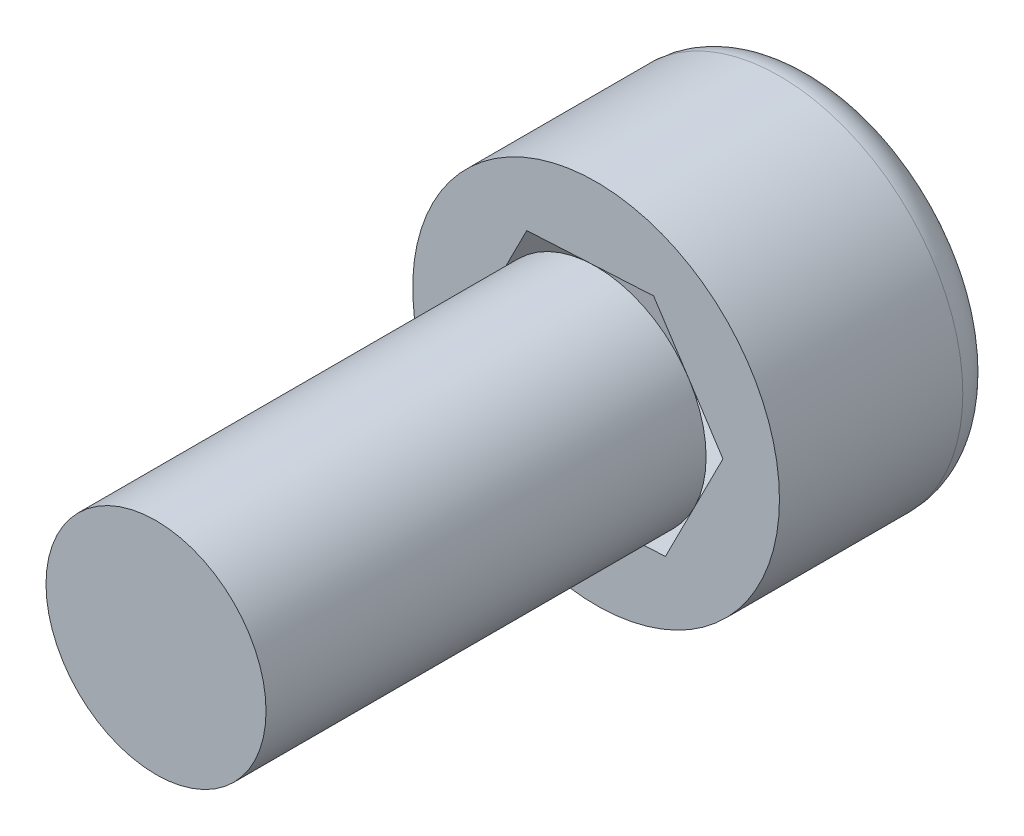
ISO-10303-21;
HEADER;
FILE_DESCRIPTION(('STEP AP214'),'2;1');
FILE_NAME('part.step','',(''),(''),'','','');
FILE_SCHEMA(('AUTOMOTIVE_DESIGN { 1 0 10303 214 1 1 1 1 }'));
ENDSEC;
DATA;
#1=APPLICATION_CONTEXT('core data for automotive mechanical design processes');
#2=APPLICATION_PROTOCOL_DEFINITION('international standard','automotive_design',2000,#1);
#3=PRODUCT_CONTEXT('',#1,'mechanical');
#4=PRODUCT('Part','Part','',(#3));
#5=PRODUCT_RELATED_PRODUCT_CATEGORY('part','',(#4));
#6=PRODUCT_DEFINITION_FORMATION('','',#4);
#7=PRODUCT_DEFINITION_CONTEXT('part definition',#1,'design');
#8=PRODUCT_DEFINITION('design','',#6,#7);
#9=PRODUCT_DEFINITION_SHAPE('','',#8);
#10=(LENGTH_UNIT() NAMED_UNIT(*) SI_UNIT(.MILLI.,.METRE.));
#11=(NAMED_UNIT(*) PLANE_ANGLE_UNIT() SI_UNIT($,.RADIAN.));
#12=(NAMED_UNIT(*) SI_UNIT($,.STERADIAN.) SOLID_ANGLE_UNIT());
#13=UNCERTAINTY_MEASURE_WITH_UNIT(LENGTH_MEASURE(1.E-05),#10,'distance_accuracy_value','');
#14=(GEOMETRIC_REPRESENTATION_CONTEXT(3) GLOBAL_UNCERTAINTY_ASSIGNED_CONTEXT((#13)) GLOBAL_UNIT_ASSIGNED_CONTEXT((#10,
#11,#12)) REPRESENTATION_CONTEXT('',''));
#15=CARTESIAN_POINT('',(0.,0.,0.));
#16=DIRECTION('',(0.,0.,1.));
#17=DIRECTION('',(1.,0.,0.));
#18=AXIS2_PLACEMENT_3D('',#15,#16,#17);
#19=CARTESIAN_POINT('',(0.,0.,3.));
#20=DIRECTION('',(0.,0.,-1.));
#21=DIRECTION('',(-1.,0.,0.));
#22=AXIS2_PLACEMENT_3D('',#19,#20,#21);
#23=CYLINDRICAL_SURFACE('',#22,2.5);
#24=CARTESIAN_POINT('',(0.,0.,0.5));
#25=DIRECTION('',(0.,0.,1.));
#26=DIRECTION('',(1.,0.,0.));
#27=AXIS2_PLACEMENT_3D('',#24,#25,#26);
#28=CIRCLE('',#27,2.5);
#29=CARTESIAN_POINT('',(2.5,0.,0.5));
#30=VERTEX_POINT('',#29);
#31=EDGE_CURVE('E50',#30,#30,#28,.T.);
#32=ORIENTED_EDGE('',*,*,#31,.T.);
#33=EDGE_LOOP('',(#32));
#34=FACE_BOUND('',#33,.T.);
#35=CARTESIAN_POINT('',(0.,0.,3.));
#36=DIRECTION('',(0.,0.,1.));
#37=DIRECTION('',(1.,0.,0.));
#38=AXIS2_PLACEMENT_3D('',#35,#36,#37);
#39=CIRCLE('',#38,2.5);
#40=CARTESIAN_POINT('',(2.5,0.,3.));
#41=VERTEX_POINT('',#40);
#42=EDGE_CURVE('E165',#41,#41,#39,.T.);
#43=ORIENTED_EDGE('',*,*,#42,.F.);
#44=EDGE_LOOP('',(#43));
#45=FACE_BOUND('',#44,.T.);
#46=ADVANCED_FACE('F41',(#34,#45),#23,.T.);
#47=CARTESIAN_POINT('',(0.,0.,3.));
#48=DIRECTION('',(0.,0.,1.));
#49=DIRECTION('',(1.,0.,0.));
#50=AXIS2_PLACEMENT_3D('',#47,#48,#49);
#51=PLANE('',#50);
#52=DIRECTION('',(-0.998565318577122,-0.0535472178079434,0.));
#53=VECTOR('',#52,1.);
#54=CARTESIAN_POINT('',(0.945103759937804,-1.45147472694203,3.));
#55=LINE('',#54,#53);
#56=CARTESIAN_POINT('',(0.945103759937804,-1.45147472694203,3.));
#57=VERTEX_POINT('',#56);
#58=CARTESIAN_POINT('',(-0.784462106513973,-1.54422122878934,3.));
#59=VERTEX_POINT('',#58);
#60=EDGE_CURVE('E94',#57,#59,#55,.T.);
#61=ORIENTED_EDGE('',*,*,#60,.T.);
#62=DIRECTION('',(-0.545655910212218,0.838009324321917,0.));
#63=VECTOR('',#62,1.);
#64=CARTESIAN_POINT('',(-0.784462106513973,-1.54422122878934,3.));
#65=LINE('',#64,#63);
#66=CARTESIAN_POINT('',(-1.72956586645178,-0.0927465018473138,3.));
#67=VERTEX_POINT('',#66);
#68=EDGE_CURVE('E57',#59,#67,#65,.T.);
#69=ORIENTED_EDGE('',*,*,#68,.T.);
#70=DIRECTION('',(0.452909408364904,0.89155654212986,0.));
#71=VECTOR('',#70,1.);
#72=CARTESIAN_POINT('',(-1.72956586645178,-0.0927465018473138,3.));
#73=LINE('',#72,#71);
#74=CARTESIAN_POINT('',(-0.945103759937803,1.45147472694203,3.));
#75=VERTEX_POINT('',#74);
#76=EDGE_CURVE('E104',#67,#75,#73,.T.);
#77=ORIENTED_EDGE('',*,*,#76,.T.);
#78=DIRECTION('',(0.998565318577122,0.0535472178079431,0.));
#79=VECTOR('',#78,1.);
#80=CARTESIAN_POINT('',(-0.945103759937803,1.45147472694203,3.));
#81=LINE('',#80,#79);
#82=CARTESIAN_POINT('',(0.784462106513974,1.54422122878934,3.));
#83=VERTEX_POINT('',#82);
#84=EDGE_CURVE('E176',#75,#83,#81,.T.);
#85=ORIENTED_EDGE('',*,*,#84,.T.);
#86=DIRECTION('',(0.545655910212218,-0.838009324321917,0.));
#87=VECTOR('',#86,1.);
#88=CARTESIAN_POINT('',(0.784462106513974,1.54422122878934,3.));
#89=LINE('',#88,#87);
#90=CARTESIAN_POINT('',(1.72956586645178,0.0927465018473145,3.));
#91=VERTEX_POINT('',#90);
#92=EDGE_CURVE('E174',#83,#91,#89,.T.);
#93=ORIENTED_EDGE('',*,*,#92,.T.);
#94=DIRECTION('',(-0.452909408364904,-0.89155654212986,0.));
#95=VECTOR('',#94,1.);
#96=CARTESIAN_POINT('',(1.72956586645178,0.0927465018473145,3.));
#97=LINE('',#96,#95);
#98=EDGE_CURVE('E109',#91,#57,#97,.T.);
#99=ORIENTED_EDGE('',*,*,#98,.T.);
#100=EDGE_LOOP('',(#61,#69,#77,#85,#93,#99));
#101=FACE_BOUND('',#100,.T.);
#102=ORIENTED_EDGE('',*,*,#42,.T.);
#103=EDGE_LOOP('',(#102));
#104=FACE_BOUND('',#103,.T.);
#105=ADVANCED_FACE('F106',(#101,#104),#51,.T.);
#106=CARTESIAN_POINT('',(0.,0.,0.));
#107=DIRECTION('',(0.,0.,1.));
#108=DIRECTION('',(1.,0.,0.));
#109=AXIS2_PLACEMENT_3D('',#106,#107,#108);
#110=PLANE('',#109);
#111=CARTESIAN_POINT('',(0.,0.,0.));
#112=DIRECTION('',(0.,0.,1.));
#113=DIRECTION('',(1.,0.,0.));
#114=AXIS2_PLACEMENT_3D('',#111,#112,#113);
#115=CIRCLE('',#114,2.);
#116=CARTESIAN_POINT('',(2.,0.,0.));
#117=VERTEX_POINT('',#116);
#118=EDGE_CURVE('E12',#117,#117,#115,.F.);
#119=ORIENTED_EDGE('',*,*,#118,.T.);
#120=EDGE_LOOP('',(#119));
#121=FACE_BOUND('',#120,.T.);
#122=DIRECTION('',(-0.545655910212218,0.838009324321917,0.));
#123=VECTOR('',#122,1.);
#124=CARTESIAN_POINT('',(-0.784462106513973,-1.54422122878934,0.));
#125=LINE('',#124,#123);
#126=CARTESIAN_POINT('',(-0.784462106513973,-1.54422122878934,0.));
#127=VERTEX_POINT('',#126);
#128=CARTESIAN_POINT('',(-1.72956586645178,-0.0927465018473138,0.));
#129=VERTEX_POINT('',#128);
#130=EDGE_CURVE('E99',#127,#129,#125,.T.);
#131=ORIENTED_EDGE('',*,*,#130,.F.);
#132=DIRECTION('',(-0.998565318577122,-0.0535472178079434,0.));
#133=VECTOR('',#132,1.);
#134=CARTESIAN_POINT('',(0.945103759937804,-1.45147472694203,0.));
#135=LINE('',#134,#133);
#136=CARTESIAN_POINT('',(0.945103759937804,-1.45147472694203,0.));
#137=VERTEX_POINT('',#136);
#138=EDGE_CURVE('E90',#137,#127,#135,.T.);
#139=ORIENTED_EDGE('',*,*,#138,.F.);
#140=DIRECTION('',(-0.452909408364904,-0.89155654212986,0.));
#141=VECTOR('',#140,1.);
#142=CARTESIAN_POINT('',(1.72956586645178,0.0927465018473145,0.));
#143=LINE('',#142,#141);
#144=CARTESIAN_POINT('',(1.72956586645178,0.0927465018473145,0.));
#145=VERTEX_POINT('',#144);
#146=EDGE_CURVE('E156',#145,#137,#143,.T.);
#147=ORIENTED_EDGE('',*,*,#146,.F.);
#148=DIRECTION('',(0.545655910212218,-0.838009324321917,0.));
#149=VECTOR('',#148,1.);
#150=CARTESIAN_POINT('',(0.784462106513974,1.54422122878934,0.));
#151=LINE('',#150,#149);
#152=CARTESIAN_POINT('',(0.784462106513974,1.54422122878934,0.));
#153=VERTEX_POINT('',#152);
#154=EDGE_CURVE('E189',#153,#145,#151,.T.);
#155=ORIENTED_EDGE('',*,*,#154,.F.);
#156=DIRECTION('',(0.998565318577122,0.0535472178079431,0.));
#157=VECTOR('',#156,1.);
#158=CARTESIAN_POINT('',(-0.945103759937803,1.45147472694203,0.));
#159=LINE('',#158,#157);
#160=CARTESIAN_POINT('',(-0.945103759937803,1.45147472694203,0.));
#161=VERTEX_POINT('',#160);
#162=EDGE_CURVE('E185',#161,#153,#159,.T.);
#163=ORIENTED_EDGE('',*,*,#162,.F.);
#164=DIRECTION('',(0.452909408364904,0.89155654212986,0.));
#165=VECTOR('',#164,1.);
#166=CARTESIAN_POINT('',(-1.72956586645178,-0.0927465018473138,0.));
#167=LINE('',#166,#165);
#168=EDGE_CURVE('E182',#129,#161,#167,.T.);
#169=ORIENTED_EDGE('',*,*,#168,.F.);
#170=EDGE_LOOP('',(#131,#139,#147,#155,#163,#169));
#171=FACE_BOUND('',#170,.T.);
#172=ADVANCED_FACE('F131',(#121,#171),#110,.F.);
#173=CARTESIAN_POINT('',(0.945103759937804,-1.45147472694203,3.));
#174=DIRECTION('',(0.0535472178079434,-0.998565318577122,0.));
#175=DIRECTION('',(0.998565318577122,0.0535472178079434,0.));
#176=AXIS2_PLACEMENT_3D('',#173,#174,#175);
#177=PLANE('',#176);
#178=ORIENTED_EDGE('',*,*,#138,.T.);
#179=DIRECTION('',(0.,0.,-1.));
#180=VECTOR('',#179,1.);
#181=CARTESIAN_POINT('',(-0.784462106513973,-1.54422122878934,3.));
#182=LINE('',#181,#180);
#183=EDGE_CURVE('E92',#59,#127,#182,.T.);
#184=ORIENTED_EDGE('',*,*,#183,.F.);
#185=ORIENTED_EDGE('',*,*,#60,.F.);
#186=DIRECTION('',(0.,0.,-1.));
#187=VECTOR('',#186,1.);
#188=CARTESIAN_POINT('',(0.945103759937804,-1.45147472694203,3.));
#189=LINE('',#188,#187);
#190=EDGE_CURVE('E157',#57,#137,#189,.T.);
#191=ORIENTED_EDGE('',*,*,#190,.T.);
#192=EDGE_LOOP('',(#178,#184,#185,#191));
#193=FACE_BOUND('',#192,.T.);
#194=ADVANCED_FACE('F93',(#193),#177,.F.);
#195=CARTESIAN_POINT('',(1.72956586645178,0.0927465018473145,3.));
#196=DIRECTION('',(0.89155654212986,-0.452909408364904,0.));
#197=DIRECTION('',(0.452909408364904,0.89155654212986,0.));
#198=AXIS2_PLACEMENT_3D('',#195,#196,#197);
#199=PLANE('',#198);
#200=ORIENTED_EDGE('',*,*,#146,.T.);
#201=ORIENTED_EDGE('',*,*,#190,.F.);
#202=ORIENTED_EDGE('',*,*,#98,.F.);
#203=DIRECTION('',(0.,0.,-1.));
#204=VECTOR('',#203,1.);
#205=CARTESIAN_POINT('',(1.72956586645178,0.0927465018473145,3.));
#206=LINE('',#205,#204);
#207=EDGE_CURVE('E159',#91,#145,#206,.T.);
#208=ORIENTED_EDGE('',*,*,#207,.T.);
#209=EDGE_LOOP('',(#200,#201,#202,#208));
#210=FACE_BOUND('',#209,.T.);
#211=ADVANCED_FACE('F138',(#210),#199,.F.);
#212=CARTESIAN_POINT('',(0.784462106513974,1.54422122878934,3.));
#213=DIRECTION('',(0.838009324321917,0.545655910212218,0.));
#214=DIRECTION('',(-0.545655910212218,0.838009324321917,0.));
#215=AXIS2_PLACEMENT_3D('',#212,#213,#214);
#216=PLANE('',#215);
#217=ORIENTED_EDGE('',*,*,#154,.T.);
#218=ORIENTED_EDGE('',*,*,#207,.F.);
#219=ORIENTED_EDGE('',*,*,#92,.F.);
#220=DIRECTION('',(0.,0.,-1.));
#221=VECTOR('',#220,1.);
#222=CARTESIAN_POINT('',(0.784462106513974,1.54422122878934,3.));
#223=LINE('',#222,#221);
#224=EDGE_CURVE('E187',#83,#153,#223,.T.);
#225=ORIENTED_EDGE('',*,*,#224,.T.);
#226=EDGE_LOOP('',(#217,#218,#219,#225));
#227=FACE_BOUND('',#226,.T.);
#228=ADVANCED_FACE('F146',(#227),#216,.F.);
#229=CARTESIAN_POINT('',(-0.945103759937803,1.45147472694203,3.));
#230=DIRECTION('',(-0.0535472178079431,0.998565318577122,0.));
#231=DIRECTION('',(-0.998565318577122,-0.0535472178079432,0.));
#232=AXIS2_PLACEMENT_3D('',#229,#230,#231);
#233=PLANE('',#232);
#234=ORIENTED_EDGE('',*,*,#162,.T.);
#235=ORIENTED_EDGE('',*,*,#224,.F.);
#236=ORIENTED_EDGE('',*,*,#84,.F.);
#237=DIRECTION('',(0.,0.,-1.));
#238=VECTOR('',#237,1.);
#239=CARTESIAN_POINT('',(-0.945103759937803,1.45147472694203,3.));
#240=LINE('',#239,#238);
#241=EDGE_CURVE('E181',#75,#161,#240,.T.);
#242=ORIENTED_EDGE('',*,*,#241,.T.);
#243=EDGE_LOOP('',(#234,#235,#236,#242));
#244=FACE_BOUND('',#243,.T.);
#245=ADVANCED_FACE('F142',(#244),#233,.F.);
#246=CARTESIAN_POINT('',(-1.72956586645178,-0.0927465018473138,3.));
#247=DIRECTION('',(-0.89155654212986,0.452909408364904,0.));
#248=DIRECTION('',(-0.452909408364904,-0.89155654212986,0.));
#249=AXIS2_PLACEMENT_3D('',#246,#247,#248);
#250=PLANE('',#249);
#251=ORIENTED_EDGE('',*,*,#168,.T.);
#252=ORIENTED_EDGE('',*,*,#241,.F.);
#253=ORIENTED_EDGE('',*,*,#76,.F.);
#254=DIRECTION('',(0.,0.,-1.));
#255=VECTOR('',#254,1.);
#256=CARTESIAN_POINT('',(-1.72956586645178,-0.0927465018473138,3.));
#257=LINE('',#256,#255);
#258=EDGE_CURVE('E102',#67,#129,#257,.T.);
#259=ORIENTED_EDGE('',*,*,#258,.T.);
#260=EDGE_LOOP('',(#251,#252,#253,#259));
#261=FACE_BOUND('',#260,.T.);
#262=ADVANCED_FACE('F123',(#261),#250,.F.);
#263=CARTESIAN_POINT('',(-0.784462106513973,-1.54422122878934,3.));
#264=DIRECTION('',(-0.838009324321917,-0.545655910212218,0.));
#265=DIRECTION('',(0.545655910212218,-0.838009324321917,0.));
#266=AXIS2_PLACEMENT_3D('',#263,#264,#265);
#267=PLANE('',#266);
#268=ORIENTED_EDGE('',*,*,#130,.T.);
#269=ORIENTED_EDGE('',*,*,#258,.F.);
#270=ORIENTED_EDGE('',*,*,#68,.F.);
#271=ORIENTED_EDGE('',*,*,#183,.T.);
#272=EDGE_LOOP('',(#268,#269,#270,#271));
#273=FACE_BOUND('',#272,.T.);
#274=ADVANCED_FACE('F101',(#273),#267,.F.);
#275=CARTESIAN_POINT('',(0.,0.,0.5));
#276=DIRECTION('',(0.,0.,1.));
#277=DIRECTION('',(1.,0.,0.));
#278=AXIS2_PLACEMENT_3D('',#275,#276,#277);
#279=TOROIDAL_SURFACE('',#278,2.,0.5);
#280=ORIENTED_EDGE('',*,*,#118,.F.);
#281=EDGE_LOOP('',(#280));
#282=FACE_BOUND('',#281,.T.);
#283=ORIENTED_EDGE('',*,*,#31,.F.);
#284=EDGE_LOOP('',(#283));
#285=FACE_BOUND('',#284,.T.);
#286=ADVANCED_FACE('F43',(#282,#285),#279,.T.);
#287=CLOSED_SHELL('',(#46,#105,#172,#194,#211,#228,#245,#262,#274,#286));
#288=MANIFOLD_SOLID_BREP('B2',#287);
#289=CARTESIAN_POINT('',(0.,0.,9.));
#290=DIRECTION('',(0.,0.,1.));
#291=DIRECTION('',(1.,0.,0.));
#292=AXIS2_PLACEMENT_3D('',#289,#290,#291);
#293=PLANE('',#292);
#294=CARTESIAN_POINT('',(0.,0.,9.));
#295=DIRECTION('',(0.,0.,1.));
#296=DIRECTION('',(1.,0.,0.));
#297=AXIS2_PLACEMENT_3D('',#294,#295,#296);
#298=CIRCLE('',#297,1.5);
#299=CARTESIAN_POINT('',(1.5,0.,9.));
#300=VERTEX_POINT('',#299);
#301=EDGE_CURVE('E260',#300,#300,#298,.T.);
#302=ORIENTED_EDGE('',*,*,#301,.T.);
#303=EDGE_LOOP('',(#302));
#304=FACE_BOUND('',#303,.T.);
#305=ADVANCED_FACE('F253',(#304),#293,.T.);
#306=CARTESIAN_POINT('',(0.,0.,9.));
#307=DIRECTION('',(0.,0.,-1.));
#308=DIRECTION('',(-1.,0.,0.));
#309=AXIS2_PLACEMENT_3D('',#306,#307,#308);
#310=CYLINDRICAL_SURFACE('',#309,1.5);
#311=ORIENTED_EDGE('',*,*,#301,.F.);
#312=EDGE_LOOP('',(#311));
#313=FACE_BOUND('',#312,.T.);
#314=CARTESIAN_POINT('',(0.,0.,3.));
#315=DIRECTION('',(0.,0.,1.));
#316=DIRECTION('',(1.,0.,0.));
#317=AXIS2_PLACEMENT_3D('',#314,#315,#316);
#318=CIRCLE('',#317,1.5);
#319=CARTESIAN_POINT('',(1.5,0.,3.));
#320=VERTEX_POINT('',#319);
#321=EDGE_CURVE('E40',#320,#320,#318,.T.);
#322=ORIENTED_EDGE('',*,*,#321,.T.);
#323=EDGE_LOOP('',(#322));
#324=FACE_BOUND('',#323,.T.);
#325=ADVANCED_FACE('F255',(#313,#324),#310,.T.);
#326=CARTESIAN_POINT('',(0.,0.,3.));
#327=DIRECTION('',(0.,0.,-1.));
#328=DIRECTION('',(-1.,0.,0.));
#329=AXIS2_PLACEMENT_3D('',#326,#327,#328);
#330=PLANE('',#329);
#331=ORIENTED_EDGE('',*,*,#321,.F.);
#332=EDGE_LOOP('',(#331));
#333=FACE_BOUND('',#332,.T.);
#334=ADVANCED_FACE('F268',(#333),#330,.T.);
#335=CLOSED_SHELL('',(#305,#325,#334));
#336=MANIFOLD_SOLID_BREP('B6',#335);
#337=ADVANCED_BREP_SHAPE_REPRESENTATION('',(#18,#288,#336),#14);
#338=SHAPE_DEFINITION_REPRESENTATION(#9,#337);
ENDSEC;
END-ISO-10303-21;
